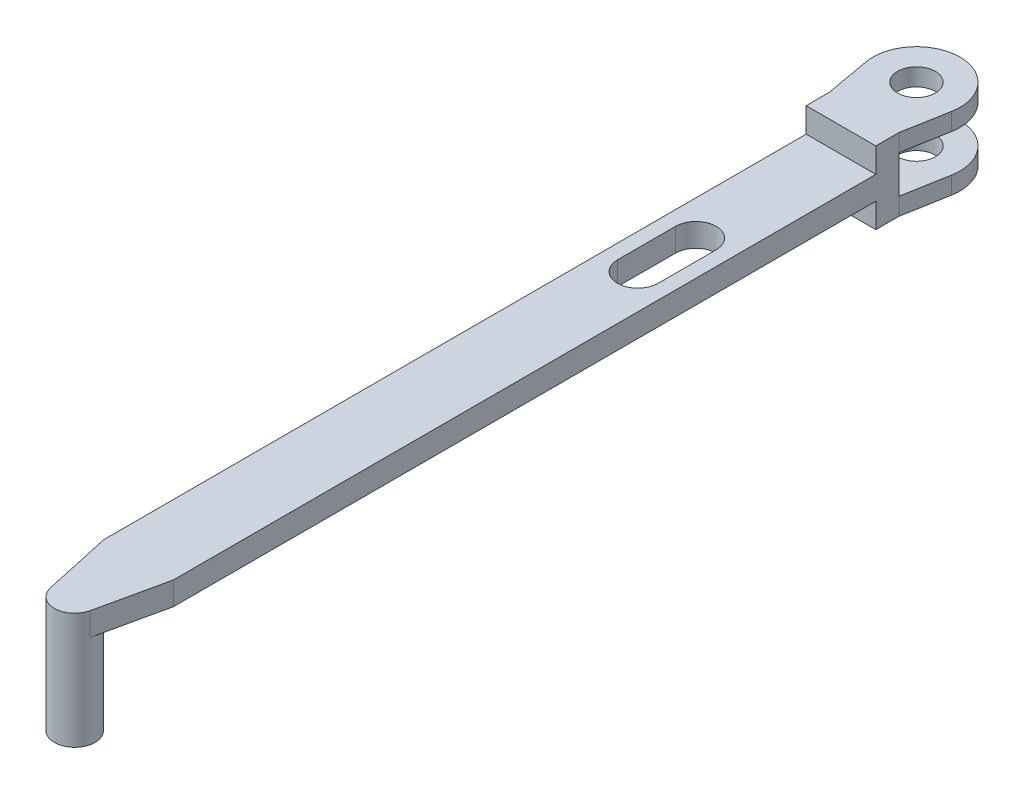
ISO-10303-21;
HEADER;
FILE_DESCRIPTION(('STEP AP214'),'2;1');
FILE_NAME('part.step','',(''),(''),'','','');
FILE_SCHEMA(('AUTOMOTIVE_DESIGN { 1 0 10303 214 1 1 1 1 }'));
ENDSEC;
DATA;
#1=APPLICATION_CONTEXT('core data for automotive mechanical design processes');
#2=APPLICATION_PROTOCOL_DEFINITION('international standard','automotive_design',2000,#1);
#3=PRODUCT_CONTEXT('',#1,'mechanical');
#4=PRODUCT('Part','Part','',(#3));
#5=PRODUCT_RELATED_PRODUCT_CATEGORY('part','',(#4));
#6=PRODUCT_DEFINITION_FORMATION('','',#4);
#7=PRODUCT_DEFINITION_CONTEXT('part definition',#1,'design');
#8=PRODUCT_DEFINITION('design','',#6,#7);
#9=PRODUCT_DEFINITION_SHAPE('','',#8);
#10=(LENGTH_UNIT() NAMED_UNIT(*) SI_UNIT(.MILLI.,.METRE.));
#11=(NAMED_UNIT(*) PLANE_ANGLE_UNIT() SI_UNIT($,.RADIAN.));
#12=(NAMED_UNIT(*) SI_UNIT($,.STERADIAN.) SOLID_ANGLE_UNIT());
#13=UNCERTAINTY_MEASURE_WITH_UNIT(LENGTH_MEASURE(1.E-05),#10,'distance_accuracy_value','');
#14=(GEOMETRIC_REPRESENTATION_CONTEXT(3) GLOBAL_UNCERTAINTY_ASSIGNED_CONTEXT((#13)) GLOBAL_UNIT_ASSIGNED_CONTEXT((#10,
#11,#12)) REPRESENTATION_CONTEXT('',''));
#15=CARTESIAN_POINT('',(0.,0.,0.));
#16=DIRECTION('',(0.,0.,1.));
#17=DIRECTION('',(1.,0.,0.));
#18=AXIS2_PLACEMENT_3D('',#15,#16,#17);
#19=CARTESIAN_POINT('',(0.,0.,13.));
#20=DIRECTION('',(0.,0.,-1.));
#21=DIRECTION('',(-1.,0.,0.));
#22=AXIS2_PLACEMENT_3D('',#19,#20,#21);
#23=PLANE('',#22);
#24=DIRECTION('',(-1.,0.,0.));
#25=VECTOR('',#24,1.);
#26=CARTESIAN_POINT('',(-6.,8.25,13.));
#27=LINE('',#26,#25);
#28=CARTESIAN_POINT('',(6.,8.25,13.));
#29=VERTEX_POINT('',#28);
#30=CARTESIAN_POINT('',(-6.,8.25,13.));
#31=VERTEX_POINT('',#30);
#32=EDGE_CURVE('E683',#29,#31,#27,.T.);
#33=ORIENTED_EDGE('',*,*,#32,.F.);
#34=DIRECTION('',(0.,1.,0.));
#35=VECTOR('',#34,1.);
#36=CARTESIAN_POINT('',(6.,0.,13.));
#37=LINE('',#36,#35);
#38=CARTESIAN_POINT('',(6.,12.5,13.));
#39=VERTEX_POINT('',#38);
#40=EDGE_CURVE('E303',#29,#39,#37,.T.);
#41=ORIENTED_EDGE('',*,*,#40,.T.);
#42=DIRECTION('',(-1.,0.,0.));
#43=VECTOR('',#42,1.);
#44=CARTESIAN_POINT('',(-6.,12.5,13.));
#45=LINE('',#44,#43);
#46=CARTESIAN_POINT('',(-6.,12.5,13.));
#47=VERTEX_POINT('',#46);
#48=EDGE_CURVE('E308',#39,#47,#45,.T.);
#49=ORIENTED_EDGE('',*,*,#48,.T.);
#50=DIRECTION('',(0.,-1.,0.));
#51=VECTOR('',#50,1.);
#52=CARTESIAN_POINT('',(-6.,0.,13.));
#53=LINE('',#52,#51);
#54=EDGE_CURVE('E295',#47,#31,#53,.T.);
#55=ORIENTED_EDGE('',*,*,#54,.T.);
#56=EDGE_LOOP('',(#33,#41,#49,#55));
#57=FACE_BOUND('',#56,.T.);
#58=ADVANCED_FACE('F45',(#57),#23,.F.);
#59=CARTESIAN_POINT('',(0.,0.,9.));
#60=DIRECTION('',(0.,0.,-1.));
#61=DIRECTION('',(-1.,0.,0.));
#62=AXIS2_PLACEMENT_3D('',#59,#60,#61);
#63=PLANE('',#62);
#64=DIRECTION('',(0.,-1.,0.));
#65=VECTOR('',#64,1.);
#66=CARTESIAN_POINT('',(-6.,0.,9.));
#67=LINE('',#66,#65);
#68=CARTESIAN_POINT('',(-6.,9.5,9.));
#69=VERTEX_POINT('',#68);
#70=CARTESIAN_POINT('',(-6.,3.,9.));
#71=VERTEX_POINT('',#70);
#72=EDGE_CURVE('E288',#69,#71,#67,.T.);
#73=ORIENTED_EDGE('',*,*,#72,.F.);
#74=DIRECTION('',(1.,0.,0.));
#75=VECTOR('',#74,1.);
#76=CARTESIAN_POINT('',(-6.,9.5,9.));
#77=LINE('',#76,#75);
#78=CARTESIAN_POINT('',(6.,9.5,9.));
#79=VERTEX_POINT('',#78);
#80=EDGE_CURVE('E267',#69,#79,#77,.T.);
#81=ORIENTED_EDGE('',*,*,#80,.T.);
#82=DIRECTION('',(0.,1.,0.));
#83=VECTOR('',#82,1.);
#84=CARTESIAN_POINT('',(6.,0.,9.));
#85=LINE('',#84,#83);
#86=CARTESIAN_POINT('',(6.,3.,9.));
#87=VERTEX_POINT('',#86);
#88=EDGE_CURVE('E316',#87,#79,#85,.T.);
#89=ORIENTED_EDGE('',*,*,#88,.F.);
#90=DIRECTION('',(1.,0.,0.));
#91=VECTOR('',#90,1.);
#92=CARTESIAN_POINT('',(-6.,3.,9.));
#93=LINE('',#92,#91);
#94=EDGE_CURVE('E340',#71,#87,#93,.T.);
#95=ORIENTED_EDGE('',*,*,#94,.F.);
#96=EDGE_LOOP('',(#73,#81,#89,#95));
#97=FACE_BOUND('',#96,.T.);
#98=ADVANCED_FACE('F405',(#97),#63,.T.);
#99=CARTESIAN_POINT('',(0.,3.,0.));
#100=DIRECTION('',(0.,-1.,0.));
#101=DIRECTION('',(0.,0.,-1.));
#102=AXIS2_PLACEMENT_3D('',#99,#100,#101);
#103=CYLINDRICAL_SURFACE('',#102,7.5);
#104=CARTESIAN_POINT('',(0.,0.,0.));
#105=DIRECTION('',(0.,1.,0.));
#106=DIRECTION('',(0.,0.,1.));
#107=AXIS2_PLACEMENT_3D('',#104,#105,#106);
#108=CIRCLE('',#107,7.5);
#109=CARTESIAN_POINT('',(7.38128575041921,0.,1.32914283305387));
#110=VERTEX_POINT('',#109);
#111=CARTESIAN_POINT('',(-7.3812857504192,0.,1.32914283305387));
#112=VERTEX_POINT('',#111);
#113=EDGE_CURVE('E334',#110,#112,#108,.T.);
#114=ORIENTED_EDGE('',*,*,#113,.T.);
#115=DIRECTION('',(0.,-1.,0.));
#116=VECTOR('',#115,1.);
#117=CARTESIAN_POINT('',(-7.3812857504192,3.,1.32914283305387));
#118=LINE('',#117,#116);
#119=CARTESIAN_POINT('',(-7.3812857504192,3.,1.32914283305387));
#120=VERTEX_POINT('',#119);
#121=EDGE_CURVE('E11',#120,#112,#118,.T.);
#122=ORIENTED_EDGE('',*,*,#121,.F.);
#123=CARTESIAN_POINT('',(0.,3.,0.));
#124=DIRECTION('',(0.,1.,0.));
#125=DIRECTION('',(0.,0.,1.));
#126=AXIS2_PLACEMENT_3D('',#123,#124,#125);
#127=CIRCLE('',#126,7.5);
#128=CARTESIAN_POINT('',(7.38128575041921,3.,1.32914283305387));
#129=VERTEX_POINT('',#128);
#130=EDGE_CURVE('E335',#129,#120,#127,.T.);
#131=ORIENTED_EDGE('',*,*,#130,.F.);
#132=DIRECTION('',(0.,-1.,0.));
#133=VECTOR('',#132,1.);
#134=CARTESIAN_POINT('',(7.38128575041921,3.,1.32914283305387));
#135=LINE('',#134,#133);
#136=EDGE_CURVE('E345',#129,#110,#135,.T.);
#137=ORIENTED_EDGE('',*,*,#136,.T.);
#138=EDGE_LOOP('',(#114,#122,#131,#137));
#139=FACE_BOUND('',#138,.T.);
#140=ADVANCED_FACE('F47',(#139),#103,.T.);
#141=CARTESIAN_POINT('',(-7.3812857504192,3.,1.32914283305387));
#142=DIRECTION('',(0.984171433389227,0.,-0.177219044407183));
#143=DIRECTION('',(-0.177219044407183,0.,-0.984171433389227));
#144=AXIS2_PLACEMENT_3D('',#141,#142,#143);
#145=PLANE('',#144);
#146=DIRECTION('',(0.177219044407183,0.,0.984171433389227));
#147=VECTOR('',#146,1.);
#148=CARTESIAN_POINT('',(-7.3812857504192,0.,1.32914283305387));
#149=LINE('',#148,#147);
#150=CARTESIAN_POINT('',(-6.,0.,9.));
#151=VERTEX_POINT('',#150);
#152=EDGE_CURVE('E349',#112,#151,#149,.T.);
#153=ORIENTED_EDGE('',*,*,#152,.T.);
#154=DIRECTION('',(0.,-1.,0.));
#155=VECTOR('',#154,1.);
#156=CARTESIAN_POINT('',(-6.,3.,9.));
#157=LINE('',#156,#155);
#158=EDGE_CURVE('E55',#71,#151,#157,.T.);
#159=ORIENTED_EDGE('',*,*,#158,.F.);
#160=DIRECTION('',(0.177219044407183,0.,0.984171433389227));
#161=VECTOR('',#160,1.);
#162=CARTESIAN_POINT('',(-7.3812857504192,3.,1.32914283305387));
#163=LINE('',#162,#161);
#164=EDGE_CURVE('E92',#120,#71,#163,.T.);
#165=ORIENTED_EDGE('',*,*,#164,.F.);
#166=ORIENTED_EDGE('',*,*,#121,.T.);
#167=EDGE_LOOP('',(#153,#159,#165,#166));
#168=FACE_BOUND('',#167,.T.);
#169=ADVANCED_FACE('F372',(#168),#145,.F.);
#170=CARTESIAN_POINT('',(6.,3.,9.));
#171=DIRECTION('',(-0.984171433389227,0.,-0.177219044407182));
#172=DIRECTION('',(-0.177219044407182,0.,0.984171433389227));
#173=AXIS2_PLACEMENT_3D('',#170,#171,#172);
#174=PLANE('',#173);
#175=DIRECTION('',(0.177219044407182,0.,-0.984171433389227));
#176=VECTOR('',#175,1.);
#177=CARTESIAN_POINT('',(6.,0.,9.));
#178=LINE('',#177,#176);
#179=CARTESIAN_POINT('',(6.,0.,9.));
#180=VERTEX_POINT('',#179);
#181=EDGE_CURVE('E86',#180,#110,#178,.T.);
#182=ORIENTED_EDGE('',*,*,#181,.T.);
#183=ORIENTED_EDGE('',*,*,#136,.F.);
#184=DIRECTION('',(0.177219044407182,0.,-0.984171433389227));
#185=VECTOR('',#184,1.);
#186=CARTESIAN_POINT('',(6.,3.,9.));
#187=LINE('',#186,#185);
#188=EDGE_CURVE('E71',#87,#129,#187,.T.);
#189=ORIENTED_EDGE('',*,*,#188,.F.);
#190=DIRECTION('',(0.,-1.,0.));
#191=VECTOR('',#190,1.);
#192=CARTESIAN_POINT('',(6.,3.,9.));
#193=LINE('',#192,#191);
#194=EDGE_CURVE('E357',#87,#180,#193,.T.);
#195=ORIENTED_EDGE('',*,*,#194,.T.);
#196=EDGE_LOOP('',(#182,#183,#189,#195));
#197=FACE_BOUND('',#196,.T.);
#198=ADVANCED_FACE('F440',(#197),#174,.F.);
#199=CARTESIAN_POINT('',(0.,3.,0.));
#200=DIRECTION('',(0.,1.,0.));
#201=DIRECTION('',(0.,0.,1.));
#202=AXIS2_PLACEMENT_3D('',#199,#200,#201);
#203=PLANE('',#202);
#204=CARTESIAN_POINT('',(0.,3.,0.));
#205=DIRECTION('',(0.,1.,0.));
#206=DIRECTION('',(0.,0.,1.));
#207=AXIS2_PLACEMENT_3D('',#204,#205,#206);
#208=CIRCLE('',#207,3.25);
#209=CARTESIAN_POINT('',(0.,3.,3.25));
#210=VERTEX_POINT('',#209);
#211=EDGE_CURVE('E253',#210,#210,#208,.T.);
#212=ORIENTED_EDGE('',*,*,#211,.F.);
#213=EDGE_LOOP('',(#212));
#214=FACE_BOUND('',#213,.T.);
#215=ORIENTED_EDGE('',*,*,#130,.T.);
#216=ORIENTED_EDGE('',*,*,#164,.T.);
#217=ORIENTED_EDGE('',*,*,#94,.T.);
#218=ORIENTED_EDGE('',*,*,#188,.T.);
#219=EDGE_LOOP('',(#215,#216,#217,#218));
#220=FACE_BOUND('',#219,.T.);
#221=ADVANCED_FACE('F437',(#214,#220),#203,.T.);
#222=CARTESIAN_POINT('',(0.,0.,0.));
#223=DIRECTION('',(0.,1.,0.));
#224=DIRECTION('',(0.,0.,1.));
#225=AXIS2_PLACEMENT_3D('',#222,#223,#224);
#226=PLANE('',#225);
#227=CARTESIAN_POINT('',(0.,0.,0.));
#228=DIRECTION('',(0.,1.,0.));
#229=DIRECTION('',(0.,0.,1.));
#230=AXIS2_PLACEMENT_3D('',#227,#228,#229);
#231=CIRCLE('',#230,3.25);
#232=CARTESIAN_POINT('',(0.,0.,3.25));
#233=VERTEX_POINT('',#232);
#234=EDGE_CURVE('E246',#233,#233,#231,.T.);
#235=ORIENTED_EDGE('',*,*,#234,.T.);
#236=EDGE_LOOP('',(#235));
#237=FACE_BOUND('',#236,.T.);
#238=ORIENTED_EDGE('',*,*,#113,.F.);
#239=ORIENTED_EDGE('',*,*,#181,.F.);
#240=DIRECTION('',(0.,0.,-1.));
#241=VECTOR('',#240,1.);
#242=CARTESIAN_POINT('',(6.,0.,13.));
#243=LINE('',#242,#241);
#244=CARTESIAN_POINT('',(6.,0.,13.));
#245=VERTEX_POINT('',#244);
#246=EDGE_CURVE('E327',#245,#180,#243,.T.);
#247=ORIENTED_EDGE('',*,*,#246,.F.);
#248=DIRECTION('',(1.,0.,0.));
#249=VECTOR('',#248,1.);
#250=CARTESIAN_POINT('',(-6.,0.,13.));
#251=LINE('',#250,#249);
#252=CARTESIAN_POINT('',(-6.,0.,13.));
#253=VERTEX_POINT('',#252);
#254=EDGE_CURVE('E299',#253,#245,#251,.T.);
#255=ORIENTED_EDGE('',*,*,#254,.F.);
#256=DIRECTION('',(0.,0.,-1.));
#257=VECTOR('',#256,1.);
#258=CARTESIAN_POINT('',(-6.,0.,13.));
#259=LINE('',#258,#257);
#260=EDGE_CURVE('E330',#253,#151,#259,.T.);
#261=ORIENTED_EDGE('',*,*,#260,.T.);
#262=ORIENTED_EDGE('',*,*,#152,.F.);
#263=EDGE_LOOP('',(#238,#239,#247,#255,#261,#262));
#264=FACE_BOUND('',#263,.T.);
#265=ADVANCED_FACE('F370',(#237,#264),#226,.F.);
#266=CARTESIAN_POINT('',(-6.,0.,13.));
#267=DIRECTION('',(1.,0.,0.));
#268=DIRECTION('',(0.,0.,-1.));
#269=AXIS2_PLACEMENT_3D('',#266,#267,#268);
#270=PLANE('',#269);
#271=CARTESIAN_POINT('',(-6.,12.5,9.));
#272=VERTEX_POINT('',#271);
#273=EDGE_CURVE('E312',#272,#69,#67,.T.);
#274=ORIENTED_EDGE('',*,*,#273,.T.);
#275=ORIENTED_EDGE('',*,*,#72,.T.);
#276=ORIENTED_EDGE('',*,*,#158,.T.);
#277=ORIENTED_EDGE('',*,*,#260,.F.);
#278=CARTESIAN_POINT('',(-6.,4.25,13.));
#279=VERTEX_POINT('',#278);
#280=EDGE_CURVE('E300',#279,#253,#53,.T.);
#281=ORIENTED_EDGE('',*,*,#280,.F.);
#282=DIRECTION('',(0.,0.,1.));
#283=VECTOR('',#282,1.);
#284=CARTESIAN_POINT('',(-6.,4.25,13.));
#285=LINE('',#284,#283);
#286=CARTESIAN_POINT('',(-5.99999999999998,4.25000000000002,134.006168685152));
#287=VERTEX_POINT('',#286);
#288=EDGE_CURVE('E62',#279,#287,#285,.T.);
#289=ORIENTED_EDGE('',*,*,#288,.T.);
#290=DIRECTION('',(0.,1.,0.));
#291=VECTOR('',#290,1.);
#292=CARTESIAN_POINT('',(-5.99999999999998,4.25000000000002,134.006168685152));
#293=LINE('',#292,#291);
#294=CARTESIAN_POINT('',(-5.99999999999998,8.25000000000001,134.006168685152));
#295=VERTEX_POINT('',#294);
#296=EDGE_CURVE('E220',#287,#295,#293,.T.);
#297=ORIENTED_EDGE('',*,*,#296,.T.);
#298=DIRECTION('',(0.,0.,1.));
#299=VECTOR('',#298,1.);
#300=CARTESIAN_POINT('',(-6.,8.25,13.));
#301=LINE('',#300,#299);
#302=EDGE_CURVE('E667',#31,#295,#301,.T.);
#303=ORIENTED_EDGE('',*,*,#302,.F.);
#304=ORIENTED_EDGE('',*,*,#54,.F.);
#305=DIRECTION('',(0.,0.,-1.));
#306=VECTOR('',#305,1.);
#307=CARTESIAN_POINT('',(-6.,12.5,13.));
#308=LINE('',#307,#306);
#309=EDGE_CURVE('E311',#47,#272,#308,.T.);
#310=ORIENTED_EDGE('',*,*,#309,.T.);
#311=EDGE_LOOP('',(#274,#275,#276,#277,#281,#289,#297,#303,#304,#310));
#312=FACE_BOUND('',#311,.T.);
#313=ADVANCED_FACE('F363',(#312),#270,.F.);
#314=CARTESIAN_POINT('',(6.,0.,13.));
#315=DIRECTION('',(-1.,0.,0.));
#316=DIRECTION('',(0.,0.,1.));
#317=AXIS2_PLACEMENT_3D('',#314,#315,#316);
#318=PLANE('',#317);
#319=ORIENTED_EDGE('',*,*,#194,.F.);
#320=ORIENTED_EDGE('',*,*,#88,.T.);
#321=DIRECTION('',(0.,1.,0.));
#322=VECTOR('',#321,1.);
#323=CARTESIAN_POINT('',(6.,9.5,9.));
#324=LINE('',#323,#322);
#325=CARTESIAN_POINT('',(6.,12.5,9.));
#326=VERTEX_POINT('',#325);
#327=EDGE_CURVE('E289',#79,#326,#324,.T.);
#328=ORIENTED_EDGE('',*,*,#327,.T.);
#329=DIRECTION('',(0.,0.,-1.));
#330=VECTOR('',#329,1.);
#331=CARTESIAN_POINT('',(6.,12.5,13.));
#332=LINE('',#331,#330);
#333=EDGE_CURVE('E323',#39,#326,#332,.T.);
#334=ORIENTED_EDGE('',*,*,#333,.F.);
#335=ORIENTED_EDGE('',*,*,#40,.F.);
#336=DIRECTION('',(0.,0.,-1.));
#337=VECTOR('',#336,1.);
#338=CARTESIAN_POINT('',(6.,8.25,13.));
#339=LINE('',#338,#337);
#340=CARTESIAN_POINT('',(6.00000000000002,8.25000000000001,134.006168685152));
#341=VERTEX_POINT('',#340);
#342=EDGE_CURVE('E680',#341,#29,#339,.T.);
#343=ORIENTED_EDGE('',*,*,#342,.F.);
#344=DIRECTION('',(0.,1.,0.));
#345=VECTOR('',#344,1.);
#346=CARTESIAN_POINT('',(6.00000000000002,4.25000000000002,134.006168685152));
#347=LINE('',#346,#345);
#348=CARTESIAN_POINT('',(6.00000000000002,4.25000000000002,134.006168685152));
#349=VERTEX_POINT('',#348);
#350=EDGE_CURVE('E238',#349,#341,#347,.T.);
#351=ORIENTED_EDGE('',*,*,#350,.F.);
#352=DIRECTION('',(0.,0.,-1.));
#353=VECTOR('',#352,1.);
#354=CARTESIAN_POINT('',(6.,4.25,13.));
#355=LINE('',#354,#353);
#356=CARTESIAN_POINT('',(6.,4.25,13.));
#357=VERTEX_POINT('',#356);
#358=EDGE_CURVE('E227',#349,#357,#355,.T.);
#359=ORIENTED_EDGE('',*,*,#358,.T.);
#360=EDGE_CURVE('E304',#245,#357,#37,.T.);
#361=ORIENTED_EDGE('',*,*,#360,.F.);
#362=ORIENTED_EDGE('',*,*,#246,.T.);
#363=EDGE_LOOP('',(#319,#320,#328,#334,#335,#343,#351,#359,#361,#362));
#364=FACE_BOUND('',#363,.T.);
#365=ADVANCED_FACE('F378',(#364),#318,.F.);
#366=CARTESIAN_POINT('',(-6.,12.5,13.));
#367=DIRECTION('',(0.,-1.,0.));
#368=DIRECTION('',(0.,0.,-1.));
#369=AXIS2_PLACEMENT_3D('',#366,#367,#368);
#370=PLANE('',#369);
#371=CARTESIAN_POINT('',(0.,12.5,0.));
#372=DIRECTION('',(0.,1.,0.));
#373=DIRECTION('',(0.,0.,1.));
#374=AXIS2_PLACEMENT_3D('',#371,#372,#373);
#375=CIRCLE('',#374,3.25);
#376=CARTESIAN_POINT('',(0.,12.5,3.25));
#377=VERTEX_POINT('',#376);
#378=EDGE_CURVE('E241',#377,#377,#375,.T.);
#379=ORIENTED_EDGE('',*,*,#378,.F.);
#380=EDGE_LOOP('',(#379));
#381=FACE_BOUND('',#380,.T.);
#382=ORIENTED_EDGE('',*,*,#333,.T.);
#383=DIRECTION('',(0.177219044407182,0.,-0.984171433389227));
#384=VECTOR('',#383,1.);
#385=CARTESIAN_POINT('',(6.,12.5,9.));
#386=LINE('',#385,#384);
#387=CARTESIAN_POINT('',(7.3812857504192,12.5,1.32914283305387));
#388=VERTEX_POINT('',#387);
#389=EDGE_CURVE('E263',#326,#388,#386,.T.);
#390=ORIENTED_EDGE('',*,*,#389,.T.);
#391=CARTESIAN_POINT('',(0.,12.5,0.));
#392=DIRECTION('',(0.,1.,0.));
#393=DIRECTION('',(0.,0.,1.));
#394=AXIS2_PLACEMENT_3D('',#391,#392,#393);
#395=CIRCLE('',#394,7.5);
#396=CARTESIAN_POINT('',(-7.3812857504192,12.5,1.32914283305387));
#397=VERTEX_POINT('',#396);
#398=EDGE_CURVE('E257',#388,#397,#395,.T.);
#399=ORIENTED_EDGE('',*,*,#398,.T.);
#400=DIRECTION('',(0.177219044407183,0.,0.984171433389227));
#401=VECTOR('',#400,1.);
#402=CARTESIAN_POINT('',(-7.3812857504192,12.5,1.32914283305387));
#403=LINE('',#402,#401);
#404=EDGE_CURVE('E279',#397,#272,#403,.T.);
#405=ORIENTED_EDGE('',*,*,#404,.T.);
#406=ORIENTED_EDGE('',*,*,#309,.F.);
#407=ORIENTED_EDGE('',*,*,#48,.F.);
#408=EDGE_LOOP('',(#382,#390,#399,#405,#406,#407));
#409=FACE_BOUND('',#408,.T.);
#410=ADVANCED_FACE('F418',(#381,#409),#370,.F.);
#411=ORIENTED_EDGE('',*,*,#360,.T.);
#412=DIRECTION('',(-1.,0.,0.));
#413=VECTOR('',#412,1.);
#414=CARTESIAN_POINT('',(-6.,4.25,13.));
#415=LINE('',#414,#413);
#416=EDGE_CURVE('E235',#357,#279,#415,.T.);
#417=ORIENTED_EDGE('',*,*,#416,.T.);
#418=ORIENTED_EDGE('',*,*,#280,.T.);
#419=ORIENTED_EDGE('',*,*,#254,.T.);
#420=EDGE_LOOP('',(#411,#417,#418,#419));
#421=FACE_BOUND('',#420,.T.);
#422=ADVANCED_FACE('F380',(#421),#23,.F.);
#423=CARTESIAN_POINT('',(0.,9.5,0.));
#424=DIRECTION('',(0.,1.,0.));
#425=DIRECTION('',(0.,0.,1.));
#426=AXIS2_PLACEMENT_3D('',#423,#424,#425);
#427=CYLINDRICAL_SURFACE('',#426,7.5);
#428=ORIENTED_EDGE('',*,*,#398,.F.);
#429=DIRECTION('',(0.,1.,0.));
#430=VECTOR('',#429,1.);
#431=CARTESIAN_POINT('',(7.3812857504192,9.5,1.32914283305387));
#432=LINE('',#431,#430);
#433=CARTESIAN_POINT('',(7.3812857504192,9.5,1.32914283305387));
#434=VERTEX_POINT('',#433);
#435=EDGE_CURVE('E285',#434,#388,#432,.T.);
#436=ORIENTED_EDGE('',*,*,#435,.F.);
#437=CARTESIAN_POINT('',(0.,9.5,0.));
#438=DIRECTION('',(0.,1.,0.));
#439=DIRECTION('',(0.,0.,1.));
#440=AXIS2_PLACEMENT_3D('',#437,#438,#439);
#441=CIRCLE('',#440,7.5);
#442=CARTESIAN_POINT('',(-7.3812857504192,9.5,1.32914283305387));
#443=VERTEX_POINT('',#442);
#444=EDGE_CURVE('E258',#434,#443,#441,.T.);
#445=ORIENTED_EDGE('',*,*,#444,.T.);
#446=DIRECTION('',(0.,1.,0.));
#447=VECTOR('',#446,1.);
#448=CARTESIAN_POINT('',(-7.3812857504192,9.5,1.32914283305387));
#449=LINE('',#448,#447);
#450=EDGE_CURVE('E275',#443,#397,#449,.T.);
#451=ORIENTED_EDGE('',*,*,#450,.T.);
#452=EDGE_LOOP('',(#428,#436,#445,#451));
#453=FACE_BOUND('',#452,.T.);
#454=ADVANCED_FACE('F417',(#453),#427,.T.);
#455=CARTESIAN_POINT('',(6.,9.5,9.));
#456=DIRECTION('',(0.984171433389227,0.,0.177219044407182));
#457=DIRECTION('',(0.177219044407182,0.,-0.984171433389227));
#458=AXIS2_PLACEMENT_3D('',#455,#456,#457);
#459=PLANE('',#458);
#460=ORIENTED_EDGE('',*,*,#389,.F.);
#461=ORIENTED_EDGE('',*,*,#327,.F.);
#462=DIRECTION('',(0.177219044407182,0.,-0.984171433389227));
#463=VECTOR('',#462,1.);
#464=CARTESIAN_POINT('',(6.,9.5,9.));
#465=LINE('',#464,#463);
#466=EDGE_CURVE('E271',#79,#434,#465,.T.);
#467=ORIENTED_EDGE('',*,*,#466,.T.);
#468=ORIENTED_EDGE('',*,*,#435,.T.);
#469=EDGE_LOOP('',(#460,#461,#467,#468));
#470=FACE_BOUND('',#469,.T.);
#471=ADVANCED_FACE('F424',(#470),#459,.T.);
#472=CARTESIAN_POINT('',(-7.3812857504192,9.5,1.32914283305387));
#473=DIRECTION('',(-0.984171433389226,0.,0.177219044407183));
#474=DIRECTION('',(0.177219044407183,0.,0.984171433389227));
#475=AXIS2_PLACEMENT_3D('',#472,#473,#474);
#476=PLANE('',#475);
#477=ORIENTED_EDGE('',*,*,#404,.F.);
#478=ORIENTED_EDGE('',*,*,#450,.F.);
#479=DIRECTION('',(0.177219044407183,0.,0.984171433389227));
#480=VECTOR('',#479,1.);
#481=CARTESIAN_POINT('',(-7.3812857504192,9.5,1.32914283305387));
#482=LINE('',#481,#480);
#483=EDGE_CURVE('E262',#443,#69,#482,.T.);
#484=ORIENTED_EDGE('',*,*,#483,.T.);
#485=ORIENTED_EDGE('',*,*,#273,.F.);
#486=EDGE_LOOP('',(#477,#478,#484,#485));
#487=FACE_BOUND('',#486,.T.);
#488=ADVANCED_FACE('F401',(#487),#476,.T.);
#489=CARTESIAN_POINT('',(0.,9.5,0.));
#490=DIRECTION('',(0.,1.,0.));
#491=DIRECTION('',(0.,0.,1.));
#492=AXIS2_PLACEMENT_3D('',#489,#490,#491);
#493=PLANE('',#492);
#494=CARTESIAN_POINT('',(0.,9.5,0.));
#495=DIRECTION('',(0.,1.,0.));
#496=DIRECTION('',(0.,0.,1.));
#497=AXIS2_PLACEMENT_3D('',#494,#495,#496);
#498=CIRCLE('',#497,3.25);
#499=CARTESIAN_POINT('',(0.,9.5,3.25));
#500=VERTEX_POINT('',#499);
#501=EDGE_CURVE('E49',#500,#500,#498,.T.);
#502=ORIENTED_EDGE('',*,*,#501,.T.);
#503=EDGE_LOOP('',(#502));
#504=FACE_BOUND('',#503,.T.);
#505=ORIENTED_EDGE('',*,*,#444,.F.);
#506=ORIENTED_EDGE('',*,*,#466,.F.);
#507=ORIENTED_EDGE('',*,*,#80,.F.);
#508=ORIENTED_EDGE('',*,*,#483,.F.);
#509=EDGE_LOOP('',(#505,#506,#507,#508));
#510=FACE_BOUND('',#509,.T.);
#511=ADVANCED_FACE('F387',(#504,#510),#493,.F.);
#512=CARTESIAN_POINT('',(0.,0.,0.));
#513=DIRECTION('',(0.,1.,0.));
#514=DIRECTION('',(0.,0.,1.));
#515=AXIS2_PLACEMENT_3D('',#512,#513,#514);
#516=CYLINDRICAL_SURFACE('',#515,3.25);
#517=ORIENTED_EDGE('',*,*,#378,.T.);
#518=EDGE_LOOP('',(#517));
#519=FACE_BOUND('',#518,.T.);
#520=ORIENTED_EDGE('',*,*,#501,.F.);
#521=EDGE_LOOP('',(#520));
#522=FACE_BOUND('',#521,.T.);
#523=ADVANCED_FACE('F390',(#519,#522),#516,.F.);
#524=ORIENTED_EDGE('',*,*,#211,.T.);
#525=EDGE_LOOP('',(#524));
#526=FACE_BOUND('',#525,.T.);
#527=ORIENTED_EDGE('',*,*,#234,.F.);
#528=EDGE_LOOP('',(#527));
#529=FACE_BOUND('',#528,.T.);
#530=ADVANCED_FACE('F392',(#526,#529),#516,.F.);
#531=CARTESIAN_POINT('',(3.41839860936548,4.25000000000002,145.751366054256));
#532=DIRECTION('',(0.976685316961566,0.,0.2146760155017));
#533=DIRECTION('',(0.2146760155017,0.,-0.976685316961566));
#534=AXIS2_PLACEMENT_3D('',#531,#532,#533);
#535=PLANE('',#534);
#536=ORIENTED_EDGE('',*,*,#350,.T.);
#537=DIRECTION('',(0.2146760155017,0.,-0.976685316961565));
#538=VECTOR('',#537,1.);
#539=CARTESIAN_POINT('',(3.41839860936548,8.25000000000002,145.751366054256));
#540=LINE('',#539,#538);
#541=CARTESIAN_POINT('',(3.41839860936548,8.25000000000002,145.751366054256));
#542=VERTEX_POINT('',#541);
#543=EDGE_CURVE('E676',#542,#341,#540,.T.);
#544=ORIENTED_EDGE('',*,*,#543,.F.);
#545=DIRECTION('',(0.,1.,0.));
#546=VECTOR('',#545,1.);
#547=CARTESIAN_POINT('',(3.41839860936548,4.25000000000002,145.751366054256));
#548=LINE('',#547,#546);
#549=CARTESIAN_POINT('',(3.41839860936548,4.25000000000002,145.751366054256));
#550=VERTEX_POINT('',#549);
#551=EDGE_CURVE('E219',#550,#542,#548,.T.);
#552=ORIENTED_EDGE('',*,*,#551,.F.);
#553=DIRECTION('',(0.2146760155017,0.,-0.976685316961565));
#554=VECTOR('',#553,1.);
#555=CARTESIAN_POINT('',(3.41839860936548,4.25000000000002,145.751366054256));
#556=LINE('',#555,#554);
#557=EDGE_CURVE('E202',#550,#349,#556,.T.);
#558=ORIENTED_EDGE('',*,*,#557,.T.);
#559=EDGE_LOOP('',(#536,#544,#552,#558));
#560=FACE_BOUND('',#559,.T.);
#561=ADVANCED_FACE('F399',(#560),#535,.T.);
#562=CARTESIAN_POINT('',(0.,4.25000000000002,145.));
#563=DIRECTION('',(0.,1.,0.));
#564=DIRECTION('',(0.,0.,1.));
#565=AXIS2_PLACEMENT_3D('',#562,#563,#564);
#566=CYLINDRICAL_SURFACE('',#565,3.5);
#567=ORIENTED_EDGE('',*,*,#551,.T.);
#568=CARTESIAN_POINT('',(0.,8.25000000000002,145.));
#569=DIRECTION('',(0.,1.,0.));
#570=DIRECTION('',(0.,0.,1.));
#571=AXIS2_PLACEMENT_3D('',#568,#569,#570);
#572=CIRCLE('',#571,3.5);
#573=CARTESIAN_POINT('',(-3.41839860936549,8.25000000000002,145.751366054256));
#574=VERTEX_POINT('',#573);
#575=EDGE_CURVE('E214',#574,#542,#572,.T.);
#576=ORIENTED_EDGE('',*,*,#575,.F.);
#577=DIRECTION('',(0.,1.,0.));
#578=VECTOR('',#577,1.);
#579=CARTESIAN_POINT('',(-3.41839860936549,4.25000000000002,145.751366054256));
#580=LINE('',#579,#578);
#581=CARTESIAN_POINT('',(-3.41839860936549,4.25000000000002,145.751366054256));
#582=VERTEX_POINT('',#581);
#583=EDGE_CURVE('E210',#582,#574,#580,.T.);
#584=ORIENTED_EDGE('',*,*,#583,.F.);
#585=CARTESIAN_POINT('',(0.,4.25000000000002,145.));
#586=DIRECTION('',(0.,1.,0.));
#587=DIRECTION('',(0.,0.,1.));
#588=AXIS2_PLACEMENT_3D('',#585,#586,#587);
#589=CIRCLE('',#588,3.50000000000001);
#590=EDGE_CURVE('E195',#550,#582,#589,.T.);
#591=ORIENTED_EDGE('',*,*,#590,.F.);
#592=EDGE_LOOP('',(#567,#576,#584,#591));
#593=FACE_BOUND('',#592,.T.);
#594=CARTESIAN_POINT('',(0.,-11.75,145.));
#595=DIRECTION('',(0.,1.,0.));
#596=DIRECTION('',(0.,0.,1.));
#597=AXIS2_PLACEMENT_3D('',#594,#595,#596);
#598=CIRCLE('',#597,3.50000000000001);
#599=CARTESIAN_POINT('',(0.,-11.75,148.5));
#600=VERTEX_POINT('',#599);
#601=EDGE_CURVE('E207',#600,#600,#598,.T.);
#602=ORIENTED_EDGE('',*,*,#601,.T.);
#603=EDGE_LOOP('',(#602));
#604=FACE_BOUND('',#603,.T.);
#605=ADVANCED_FACE('F211',(#593,#604),#566,.T.);
#606=CARTESIAN_POINT('',(-3.41839860936549,4.25000000000002,145.751366054256));
#607=DIRECTION('',(-0.976685316961566,0.,0.214676015501697));
#608=DIRECTION('',(0.214676015501697,0.,0.976685316961566));
#609=AXIS2_PLACEMENT_3D('',#606,#607,#608);
#610=PLANE('',#609);
#611=ORIENTED_EDGE('',*,*,#583,.T.);
#612=DIRECTION('',(0.214676015501697,0.,0.976685316961566));
#613=VECTOR('',#612,1.);
#614=CARTESIAN_POINT('',(-3.41839860936549,8.25000000000002,145.751366054256));
#615=LINE('',#614,#613);
#616=EDGE_CURVE('E671',#295,#574,#615,.T.);
#617=ORIENTED_EDGE('',*,*,#616,.F.);
#618=ORIENTED_EDGE('',*,*,#296,.F.);
#619=DIRECTION('',(0.214676015501697,0.,0.976685316961566));
#620=VECTOR('',#619,1.);
#621=CARTESIAN_POINT('',(-3.41839860936549,4.25000000000002,145.751366054256));
#622=LINE('',#621,#620);
#623=EDGE_CURVE('E199',#287,#582,#622,.T.);
#624=ORIENTED_EDGE('',*,*,#623,.T.);
#625=EDGE_LOOP('',(#611,#617,#618,#624));
#626=FACE_BOUND('',#625,.T.);
#627=ADVANCED_FACE('F222',(#626),#610,.T.);
#628=CARTESIAN_POINT('',(0.,4.25000000000002,145.));
#629=DIRECTION('',(0.,1.,0.));
#630=DIRECTION('',(0.,0.,1.));
#631=AXIS2_PLACEMENT_3D('',#628,#629,#630);
#632=PLANE('',#631);
#633=DIRECTION('',(0.,0.,-1.));
#634=VECTOR('',#633,1.);
#635=CARTESIAN_POINT('',(3.5,4.25,38.));
#636=LINE('',#635,#634);
#637=CARTESIAN_POINT('',(3.49999999999999,4.25000000000001,48.));
#638=VERTEX_POINT('',#637);
#639=CARTESIAN_POINT('',(3.5,4.25,38.));
#640=VERTEX_POINT('',#639);
#641=EDGE_CURVE('E698',#638,#640,#636,.T.);
#642=ORIENTED_EDGE('',*,*,#641,.T.);
#643=CARTESIAN_POINT('',(0.,4.25,38.));
#644=DIRECTION('',(0.,1.,0.));
#645=DIRECTION('',(0.,0.,1.));
#646=AXIS2_PLACEMENT_3D('',#643,#644,#645);
#647=CIRCLE('',#646,3.5);
#648=CARTESIAN_POINT('',(-3.5,4.25,38.));
#649=VERTEX_POINT('',#648);
#650=EDGE_CURVE('E686',#640,#649,#647,.T.);
#651=ORIENTED_EDGE('',*,*,#650,.T.);
#652=DIRECTION('',(0.,0.,1.));
#653=VECTOR('',#652,1.);
#654=CARTESIAN_POINT('',(-3.5,4.25,38.));
#655=LINE('',#654,#653);
#656=CARTESIAN_POINT('',(-3.49999999999999,4.25000000000001,48.));
#657=VERTEX_POINT('',#656);
#658=EDGE_CURVE('E690',#649,#657,#655,.T.);
#659=ORIENTED_EDGE('',*,*,#658,.T.);
#660=CARTESIAN_POINT('',(0.,4.25000000000001,48.));
#661=DIRECTION('',(0.,1.,0.));
#662=DIRECTION('',(0.,0.,1.));
#663=AXIS2_PLACEMENT_3D('',#660,#661,#662);
#664=CIRCLE('',#663,3.49999999999999);
#665=EDGE_CURVE('E694',#657,#638,#664,.T.);
#666=ORIENTED_EDGE('',*,*,#665,.T.);
#667=EDGE_LOOP('',(#642,#651,#659,#666));
#668=FACE_BOUND('',#667,.T.);
#669=ORIENTED_EDGE('',*,*,#557,.F.);
#670=ORIENTED_EDGE('',*,*,#590,.T.);
#671=ORIENTED_EDGE('',*,*,#623,.F.);
#672=ORIENTED_EDGE('',*,*,#288,.F.);
#673=ORIENTED_EDGE('',*,*,#416,.F.);
#674=ORIENTED_EDGE('',*,*,#358,.F.);
#675=EDGE_LOOP('',(#669,#670,#671,#672,#673,#674));
#676=FACE_BOUND('',#675,.T.);
#677=ADVANCED_FACE('F197',(#668,#676),#632,.F.);
#678=CARTESIAN_POINT('',(0.,4.25,38.));
#679=DIRECTION('',(0.,1.,0.));
#680=DIRECTION('',(0.,0.,1.));
#681=AXIS2_PLACEMENT_3D('',#678,#679,#680);
#682=CYLINDRICAL_SURFACE('',#681,3.5);
#683=DIRECTION('',(0.,1.,0.));
#684=VECTOR('',#683,1.);
#685=CARTESIAN_POINT('',(3.5,4.25,38.));
#686=LINE('',#685,#684);
#687=CARTESIAN_POINT('',(3.5,8.25,38.));
#688=VERTEX_POINT('',#687);
#689=EDGE_CURVE('E229',#640,#688,#686,.T.);
#690=ORIENTED_EDGE('',*,*,#689,.T.);
#691=CARTESIAN_POINT('',(0.,8.25,38.));
#692=DIRECTION('',(0.,1.,0.));
#693=DIRECTION('',(0.,0.,1.));
#694=AXIS2_PLACEMENT_3D('',#691,#692,#693);
#695=CIRCLE('',#694,3.5);
#696=CARTESIAN_POINT('',(-3.5,8.25,38.));
#697=VERTEX_POINT('',#696);
#698=EDGE_CURVE('E206',#688,#697,#695,.T.);
#699=ORIENTED_EDGE('',*,*,#698,.T.);
#700=DIRECTION('',(0.,1.,0.));
#701=VECTOR('',#700,1.);
#702=CARTESIAN_POINT('',(-3.5,4.25,38.));
#703=LINE('',#702,#701);
#704=EDGE_CURVE('E702',#649,#697,#703,.T.);
#705=ORIENTED_EDGE('',*,*,#704,.F.);
#706=ORIENTED_EDGE('',*,*,#650,.F.);
#707=EDGE_LOOP('',(#690,#699,#705,#706));
#708=FACE_BOUND('',#707,.T.);
#709=ADVANCED_FACE('F579',(#708),#682,.F.);
#710=CARTESIAN_POINT('',(3.5,4.25,38.));
#711=DIRECTION('',(1.,0.,0.));
#712=DIRECTION('',(0.,0.,-1.));
#713=AXIS2_PLACEMENT_3D('',#710,#711,#712);
#714=PLANE('',#713);
#715=DIRECTION('',(0.,1.,0.));
#716=VECTOR('',#715,1.);
#717=CARTESIAN_POINT('',(3.49999999999999,4.25000000000001,48.));
#718=LINE('',#717,#716);
#719=CARTESIAN_POINT('',(3.49999999999999,8.25000000000001,48.));
#720=VERTEX_POINT('',#719);
#721=EDGE_CURVE('E705',#638,#720,#718,.T.);
#722=ORIENTED_EDGE('',*,*,#721,.T.);
#723=DIRECTION('',(0.,0.,-1.));
#724=VECTOR('',#723,1.);
#725=CARTESIAN_POINT('',(3.5,8.25,38.));
#726=LINE('',#725,#724);
#727=EDGE_CURVE('E663',#720,#688,#726,.T.);
#728=ORIENTED_EDGE('',*,*,#727,.T.);
#729=ORIENTED_EDGE('',*,*,#689,.F.);
#730=ORIENTED_EDGE('',*,*,#641,.F.);
#731=EDGE_LOOP('',(#722,#728,#729,#730));
#732=FACE_BOUND('',#731,.T.);
#733=ADVANCED_FACE('F587',(#732),#714,.F.);
#734=CARTESIAN_POINT('',(0.,4.25000000000001,48.));
#735=DIRECTION('',(0.,1.,0.));
#736=DIRECTION('',(0.,0.,1.));
#737=AXIS2_PLACEMENT_3D('',#734,#735,#736);
#738=CYLINDRICAL_SURFACE('',#737,3.49999999999999);
#739=DIRECTION('',(0.,1.,0.));
#740=VECTOR('',#739,1.);
#741=CARTESIAN_POINT('',(-3.49999999999999,4.25000000000001,48.));
#742=LINE('',#741,#740);
#743=CARTESIAN_POINT('',(-3.49999999999999,8.25000000000001,48.));
#744=VERTEX_POINT('',#743);
#745=EDGE_CURVE('E708',#657,#744,#742,.T.);
#746=ORIENTED_EDGE('',*,*,#745,.T.);
#747=CARTESIAN_POINT('',(0.,8.25000000000001,48.));
#748=DIRECTION('',(0.,1.,0.));
#749=DIRECTION('',(0.,0.,1.));
#750=AXIS2_PLACEMENT_3D('',#747,#748,#749);
#751=CIRCLE('',#750,3.49999999999999);
#752=EDGE_CURVE('E659',#744,#720,#751,.T.);
#753=ORIENTED_EDGE('',*,*,#752,.T.);
#754=ORIENTED_EDGE('',*,*,#721,.F.);
#755=ORIENTED_EDGE('',*,*,#665,.F.);
#756=EDGE_LOOP('',(#746,#753,#754,#755));
#757=FACE_BOUND('',#756,.T.);
#758=ADVANCED_FACE('F596',(#757),#738,.F.);
#759=CARTESIAN_POINT('',(-3.5,4.25,38.));
#760=DIRECTION('',(-1.,0.,0.));
#761=DIRECTION('',(0.,0.,1.));
#762=AXIS2_PLACEMENT_3D('',#759,#760,#761);
#763=PLANE('',#762);
#764=ORIENTED_EDGE('',*,*,#704,.T.);
#765=DIRECTION('',(0.,0.,1.));
#766=VECTOR('',#765,1.);
#767=CARTESIAN_POINT('',(-3.5,8.25,38.));
#768=LINE('',#767,#766);
#769=EDGE_CURVE('E655',#697,#744,#768,.T.);
#770=ORIENTED_EDGE('',*,*,#769,.T.);
#771=ORIENTED_EDGE('',*,*,#745,.F.);
#772=ORIENTED_EDGE('',*,*,#658,.F.);
#773=EDGE_LOOP('',(#764,#770,#771,#772));
#774=FACE_BOUND('',#773,.T.);
#775=ADVANCED_FACE('F605',(#774),#763,.F.);
#776=CARTESIAN_POINT('',(0.,8.25000000000002,145.));
#777=DIRECTION('',(0.,1.,0.));
#778=DIRECTION('',(0.,0.,1.));
#779=AXIS2_PLACEMENT_3D('',#776,#777,#778);
#780=PLANE('',#779);
#781=ORIENTED_EDGE('',*,*,#616,.T.);
#782=ORIENTED_EDGE('',*,*,#575,.T.);
#783=ORIENTED_EDGE('',*,*,#543,.T.);
#784=ORIENTED_EDGE('',*,*,#342,.T.);
#785=ORIENTED_EDGE('',*,*,#32,.T.);
#786=ORIENTED_EDGE('',*,*,#302,.T.);
#787=EDGE_LOOP('',(#781,#782,#783,#784,#785,#786));
#788=FACE_BOUND('',#787,.T.);
#789=ORIENTED_EDGE('',*,*,#769,.F.);
#790=ORIENTED_EDGE('',*,*,#698,.F.);
#791=ORIENTED_EDGE('',*,*,#727,.F.);
#792=ORIENTED_EDGE('',*,*,#752,.F.);
#793=EDGE_LOOP('',(#789,#790,#791,#792));
#794=FACE_BOUND('',#793,.T.);
#795=ADVANCED_FACE('F614',(#788,#794),#780,.T.);
#796=CARTESIAN_POINT('',(0.,-11.75,145.));
#797=DIRECTION('',(0.,1.,0.));
#798=DIRECTION('',(0.,0.,1.));
#799=AXIS2_PLACEMENT_3D('',#796,#797,#798);
#800=PLANE('',#799);
#801=ORIENTED_EDGE('',*,*,#601,.F.);
#802=EDGE_LOOP('',(#801));
#803=FACE_BOUND('',#802,.T.);
#804=ADVANCED_FACE('F623',(#803),#800,.F.);
#805=CLOSED_SHELL('',(#58,#98,#140,#169,#198,#221,#265,#313,#365,#410,#422,#454,#471,#488,#511,
#523,#530,#561,#605,#627,#677,#709,#733,#758,#775,#795,#804));
#806=MANIFOLD_SOLID_BREP('B2',#805);
#807=ADVANCED_BREP_SHAPE_REPRESENTATION('',(#18,#806),#14);
#808=SHAPE_DEFINITION_REPRESENTATION(#9,#807);
ENDSEC;
END-ISO-10303-21;
